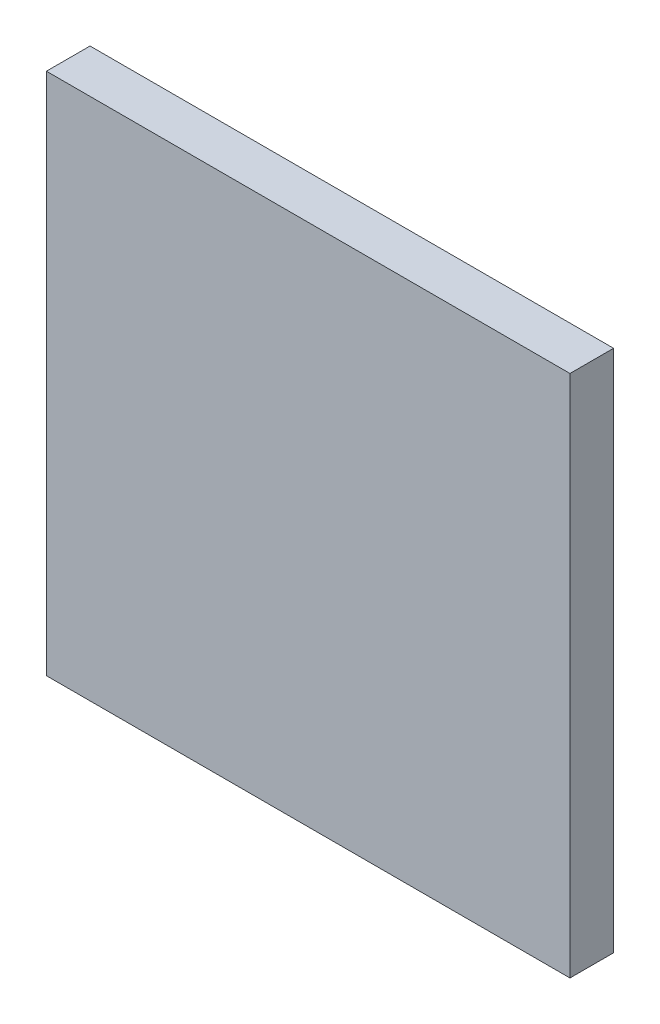
ISO-10303-21;
HEADER;
FILE_DESCRIPTION(('STEP AP214'),'2;1');
FILE_NAME('part.step','',(''),(''),'','','');
FILE_SCHEMA(('AUTOMOTIVE_DESIGN { 1 0 10303 214 1 1 1 1 }'));
ENDSEC;
DATA;
#1=APPLICATION_CONTEXT('core data for automotive mechanical design processes');
#2=APPLICATION_PROTOCOL_DEFINITION('international standard','automotive_design',2000,#1);
#3=PRODUCT_CONTEXT('',#1,'mechanical');
#4=PRODUCT('Part','Part','',(#3));
#5=PRODUCT_RELATED_PRODUCT_CATEGORY('part','',(#4));
#6=PRODUCT_DEFINITION_FORMATION('','',#4);
#7=PRODUCT_DEFINITION_CONTEXT('part definition',#1,'design');
#8=PRODUCT_DEFINITION('design','',#6,#7);
#9=PRODUCT_DEFINITION_SHAPE('','',#8);
#10=(LENGTH_UNIT() NAMED_UNIT(*) SI_UNIT(.MILLI.,.METRE.));
#11=(NAMED_UNIT(*) PLANE_ANGLE_UNIT() SI_UNIT($,.RADIAN.));
#12=(NAMED_UNIT(*) SI_UNIT($,.STERADIAN.) SOLID_ANGLE_UNIT());
#13=UNCERTAINTY_MEASURE_WITH_UNIT(LENGTH_MEASURE(1.E-05),#10,'distance_accuracy_value','');
#14=(GEOMETRIC_REPRESENTATION_CONTEXT(3) GLOBAL_UNCERTAINTY_ASSIGNED_CONTEXT((#13)) GLOBAL_UNIT_ASSIGNED_CONTEXT((#10,
#11,#12)) REPRESENTATION_CONTEXT('',''));
#15=CARTESIAN_POINT('',(0.,0.,0.));
#16=DIRECTION('',(0.,0.,1.));
#17=DIRECTION('',(1.,0.,0.));
#18=AXIS2_PLACEMENT_3D('',#15,#16,#17);
#19=CARTESIAN_POINT('',(19.05,19.05,3.175));
#20=DIRECTION('',(-1.,0.,0.));
#21=DIRECTION('',(0.,-1.,0.));
#22=AXIS2_PLACEMENT_3D('',#19,#20,#21);
#23=PLANE('',#22);
#24=DIRECTION('',(0.,1.,0.));
#25=VECTOR('',#24,1.);
#26=CARTESIAN_POINT('',(19.05,19.05,0.));
#27=LINE('',#26,#25);
#28=CARTESIAN_POINT('',(19.05,-19.05,0.));
#29=VERTEX_POINT('',#28);
#30=CARTESIAN_POINT('',(19.05,19.05,0.));
#31=VERTEX_POINT('',#30);
#32=EDGE_CURVE('E99',#29,#31,#27,.T.);
#33=ORIENTED_EDGE('',*,*,#32,.T.);
#34=DIRECTION('',(0.,0.,-1.));
#35=VECTOR('',#34,1.);
#36=CARTESIAN_POINT('',(19.05,19.05,3.175));
#37=LINE('',#36,#35);
#38=CARTESIAN_POINT('',(19.05,19.05,3.175));
#39=VERTEX_POINT('',#38);
#40=EDGE_CURVE('E11',#39,#31,#37,.T.);
#41=ORIENTED_EDGE('',*,*,#40,.F.);
#42=DIRECTION('',(0.,1.,0.));
#43=VECTOR('',#42,1.);
#44=CARTESIAN_POINT('',(19.05,19.05,3.175));
#45=LINE('',#44,#43);
#46=CARTESIAN_POINT('',(19.05,-19.05,3.175));
#47=VERTEX_POINT('',#46);
#48=EDGE_CURVE('E87',#47,#39,#45,.T.);
#49=ORIENTED_EDGE('',*,*,#48,.F.);
#50=DIRECTION('',(0.,0.,-1.));
#51=VECTOR('',#50,1.);
#52=CARTESIAN_POINT('',(19.05,-19.05,3.175));
#53=LINE('',#52,#51);
#54=EDGE_CURVE('E95',#47,#29,#53,.T.);
#55=ORIENTED_EDGE('',*,*,#54,.T.);
#56=EDGE_LOOP('',(#33,#41,#49,#55));
#57=FACE_BOUND('',#56,.T.);
#58=ADVANCED_FACE('F36',(#57),#23,.F.);
#59=CARTESIAN_POINT('',(-19.05,19.05,3.175));
#60=DIRECTION('',(0.,-1.,0.));
#61=DIRECTION('',(0.,0.,-1.));
#62=AXIS2_PLACEMENT_3D('',#59,#60,#61);
#63=PLANE('',#62);
#64=DIRECTION('',(-1.,0.,0.));
#65=VECTOR('',#64,1.);
#66=CARTESIAN_POINT('',(-19.05,19.05,0.));
#67=LINE('',#66,#65);
#68=CARTESIAN_POINT('',(-19.05,19.05,0.));
#69=VERTEX_POINT('',#68);
#70=EDGE_CURVE('E91',#31,#69,#67,.T.);
#71=ORIENTED_EDGE('',*,*,#70,.T.);
#72=DIRECTION('',(0.,0.,-1.));
#73=VECTOR('',#72,1.);
#74=CARTESIAN_POINT('',(-19.05,19.05,3.175));
#75=LINE('',#74,#73);
#76=CARTESIAN_POINT('',(-19.05,19.05,3.175));
#77=VERTEX_POINT('',#76);
#78=EDGE_CURVE('E44',#77,#69,#75,.T.);
#79=ORIENTED_EDGE('',*,*,#78,.F.);
#80=DIRECTION('',(-1.,0.,0.));
#81=VECTOR('',#80,1.);
#82=CARTESIAN_POINT('',(-19.05,19.05,3.175));
#83=LINE('',#82,#81);
#84=EDGE_CURVE('E82',#39,#77,#83,.T.);
#85=ORIENTED_EDGE('',*,*,#84,.F.);
#86=ORIENTED_EDGE('',*,*,#40,.T.);
#87=EDGE_LOOP('',(#71,#79,#85,#86));
#88=FACE_BOUND('',#87,.T.);
#89=ADVANCED_FACE('F90',(#88),#63,.F.);
#90=CARTESIAN_POINT('',(-19.05,19.05,3.175));
#91=DIRECTION('',(1.,0.,0.));
#92=DIRECTION('',(0.,1.,0.));
#93=AXIS2_PLACEMENT_3D('',#90,#91,#92);
#94=PLANE('',#93);
#95=DIRECTION('',(0.,-1.,0.));
#96=VECTOR('',#95,1.);
#97=CARTESIAN_POINT('',(-19.05,19.05,0.));
#98=LINE('',#97,#96);
#99=CARTESIAN_POINT('',(-19.05,-19.05,0.));
#100=VERTEX_POINT('',#99);
#101=EDGE_CURVE('E69',#69,#100,#98,.T.);
#102=ORIENTED_EDGE('',*,*,#101,.T.);
#103=DIRECTION('',(0.,0.,-1.));
#104=VECTOR('',#103,1.);
#105=CARTESIAN_POINT('',(-19.05,-19.05,3.175));
#106=LINE('',#105,#104);
#107=CARTESIAN_POINT('',(-19.05,-19.05,3.175));
#108=VERTEX_POINT('',#107);
#109=EDGE_CURVE('E92',#108,#100,#106,.T.);
#110=ORIENTED_EDGE('',*,*,#109,.F.);
#111=DIRECTION('',(0.,-1.,0.));
#112=VECTOR('',#111,1.);
#113=CARTESIAN_POINT('',(-19.05,19.05,3.175));
#114=LINE('',#113,#112);
#115=EDGE_CURVE('E85',#77,#108,#114,.T.);
#116=ORIENTED_EDGE('',*,*,#115,.F.);
#117=ORIENTED_EDGE('',*,*,#78,.T.);
#118=EDGE_LOOP('',(#102,#110,#116,#117));
#119=FACE_BOUND('',#118,.T.);
#120=ADVANCED_FACE('F93',(#119),#94,.F.);
#121=CARTESIAN_POINT('',(-19.05,-19.05,3.175));
#122=DIRECTION('',(0.,1.,0.));
#123=DIRECTION('',(0.,0.,1.));
#124=AXIS2_PLACEMENT_3D('',#121,#122,#123);
#125=PLANE('',#124);
#126=DIRECTION('',(1.,0.,0.));
#127=VECTOR('',#126,1.);
#128=CARTESIAN_POINT('',(-19.05,-19.05,0.));
#129=LINE('',#128,#127);
#130=EDGE_CURVE('E75',#100,#29,#129,.T.);
#131=ORIENTED_EDGE('',*,*,#130,.T.);
#132=ORIENTED_EDGE('',*,*,#54,.F.);
#133=DIRECTION('',(1.,0.,0.));
#134=VECTOR('',#133,1.);
#135=CARTESIAN_POINT('',(-19.05,-19.05,3.175));
#136=LINE('',#135,#134);
#137=EDGE_CURVE('E52',#108,#47,#136,.T.);
#138=ORIENTED_EDGE('',*,*,#137,.F.);
#139=ORIENTED_EDGE('',*,*,#109,.T.);
#140=EDGE_LOOP('',(#131,#132,#138,#139));
#141=FACE_BOUND('',#140,.T.);
#142=ADVANCED_FACE('F106',(#141),#125,.F.);
#143=CARTESIAN_POINT('',(0.,0.,3.175));
#144=DIRECTION('',(0.,0.,1.));
#145=DIRECTION('',(1.,0.,0.));
#146=AXIS2_PLACEMENT_3D('',#143,#144,#145);
#147=PLANE('',#146);
#148=ORIENTED_EDGE('',*,*,#48,.T.);
#149=ORIENTED_EDGE('',*,*,#84,.T.);
#150=ORIENTED_EDGE('',*,*,#115,.T.);
#151=ORIENTED_EDGE('',*,*,#137,.T.);
#152=EDGE_LOOP('',(#148,#149,#150,#151));
#153=FACE_BOUND('',#152,.T.);
#154=ADVANCED_FACE('F83',(#153),#147,.T.);
#155=CARTESIAN_POINT('',(0.,0.,0.));
#156=DIRECTION('',(0.,0.,1.));
#157=DIRECTION('',(1.,0.,0.));
#158=AXIS2_PLACEMENT_3D('',#155,#156,#157);
#159=PLANE('',#158);
#160=ORIENTED_EDGE('',*,*,#32,.F.);
#161=ORIENTED_EDGE('',*,*,#130,.F.);
#162=ORIENTED_EDGE('',*,*,#101,.F.);
#163=ORIENTED_EDGE('',*,*,#70,.F.);
#164=EDGE_LOOP('',(#160,#161,#162,#163));
#165=FACE_BOUND('',#164,.T.);
#166=ADVANCED_FACE('F109',(#165),#159,.F.);
#167=CLOSED_SHELL('',(#58,#89,#120,#142,#154,#166));
#168=MANIFOLD_SOLID_BREP('B2',#167);
#169=ADVANCED_BREP_SHAPE_REPRESENTATION('',(#18,#168),#14);
#170=SHAPE_DEFINITION_REPRESENTATION(#9,#169);
ENDSEC;
END-ISO-10303-21;
